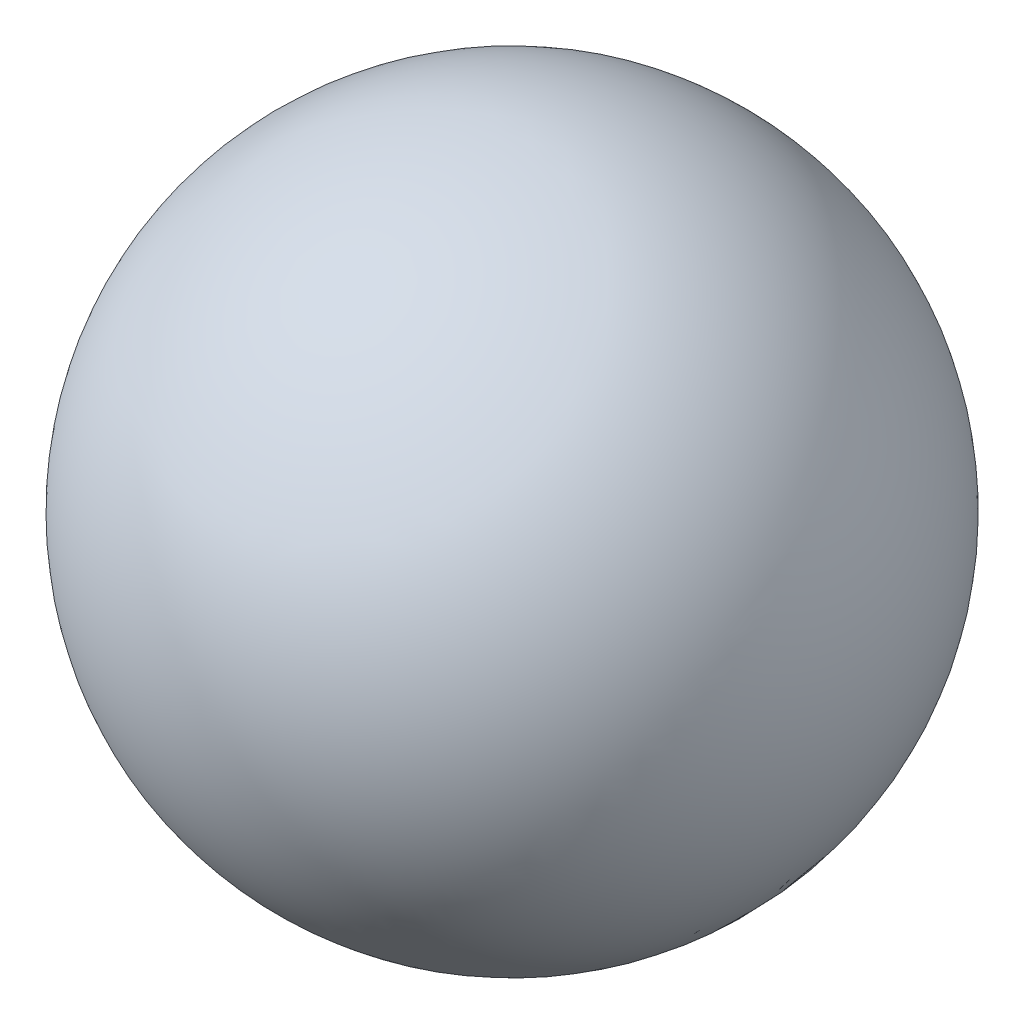
ISO-10303-21;
HEADER;
FILE_DESCRIPTION(('STEP AP214'),'2;1');
FILE_NAME('part.step','',(''),(''),'','','');
FILE_SCHEMA(('AUTOMOTIVE_DESIGN { 1 0 10303 214 1 1 1 1 }'));
ENDSEC;
DATA;
#1=APPLICATION_CONTEXT('core data for automotive mechanical design processes');
#2=APPLICATION_PROTOCOL_DEFINITION('international standard','automotive_design',2000,#1);
#3=PRODUCT_CONTEXT('',#1,'mechanical');
#4=PRODUCT('Part','Part','',(#3));
#5=PRODUCT_RELATED_PRODUCT_CATEGORY('part','',(#4));
#6=PRODUCT_DEFINITION_FORMATION('','',#4);
#7=PRODUCT_DEFINITION_CONTEXT('part definition',#1,'design');
#8=PRODUCT_DEFINITION('design','',#6,#7);
#9=PRODUCT_DEFINITION_SHAPE('','',#8);
#10=(LENGTH_UNIT() NAMED_UNIT(*) SI_UNIT(.MILLI.,.METRE.));
#11=(NAMED_UNIT(*) PLANE_ANGLE_UNIT() SI_UNIT($,.RADIAN.));
#12=(NAMED_UNIT(*) SI_UNIT($,.STERADIAN.) SOLID_ANGLE_UNIT());
#13=UNCERTAINTY_MEASURE_WITH_UNIT(LENGTH_MEASURE(1.E-05),#10,'distance_accuracy_value','');
#14=(GEOMETRIC_REPRESENTATION_CONTEXT(3) GLOBAL_UNCERTAINTY_ASSIGNED_CONTEXT((#13)) GLOBAL_UNIT_ASSIGNED_CONTEXT((#10,
#11,#12)) REPRESENTATION_CONTEXT('',''));
#15=CARTESIAN_POINT('',(0.,0.,0.));
#16=DIRECTION('',(0.,0.,1.));
#17=DIRECTION('',(1.,0.,0.));
#18=AXIS2_PLACEMENT_3D('',#15,#16,#17);
#19=CARTESIAN_POINT('',(0.,0.,0.));
#20=DIRECTION('',(0.463236250718848,0.0886994219053171,0.881784887925398));
#21=DIRECTION('',(0.656236586226661,-0.70303793810338,-0.274027736707302));
#22=AXIS2_PLACEMENT_3D('',#19,#20,#21);
#23=SPHERICAL_SURFACE('',#22,1.1905);
#24=CARTESIAN_POINT('',(0.551482756480788,0.105596661778281,1.04976490907519));
#25=VERTEX_POINT('',#24);
#26=VERTEX_LOOP('',#25);
#27=FACE_BOUND('',#26,.T.);
#28=CARTESIAN_POINT('',(-0.551482756480789,-0.105596661778279,-1.04976490907519));
#29=VERTEX_POINT('',#28);
#30=VERTEX_LOOP('',#29);
#31=FACE_BOUND('',#30,.T.);
#32=ADVANCED_FACE('F15',(#27,#31),#23,.T.);
#33=CLOSED_SHELL('',(#32));
#34=MANIFOLD_SOLID_BREP('B1',#33);
#35=ADVANCED_BREP_SHAPE_REPRESENTATION('',(#18,#34),#14);
#36=SHAPE_DEFINITION_REPRESENTATION(#9,#35);
ENDSEC;
END-ISO-10303-21;
